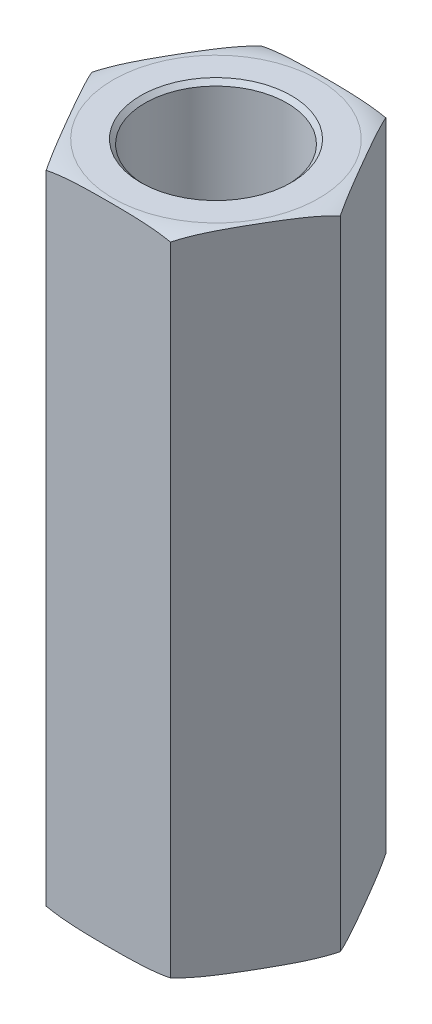
ISO-10303-21;
HEADER;
FILE_DESCRIPTION(('STEP AP214'),'2;1');
FILE_NAME('part.step','',(''),(''),'','','');
FILE_SCHEMA(('AUTOMOTIVE_DESIGN { 1 0 10303 214 1 1 1 1 }'));
ENDSEC;
DATA;
#1=APPLICATION_CONTEXT('core data for automotive mechanical design processes');
#2=APPLICATION_PROTOCOL_DEFINITION('international standard','automotive_design',2000,#1);
#3=PRODUCT_CONTEXT('',#1,'mechanical');
#4=PRODUCT('Part','Part','',(#3));
#5=PRODUCT_RELATED_PRODUCT_CATEGORY('part','',(#4));
#6=PRODUCT_DEFINITION_FORMATION('','',#4);
#7=PRODUCT_DEFINITION_CONTEXT('part definition',#1,'design');
#8=PRODUCT_DEFINITION('design','',#6,#7);
#9=PRODUCT_DEFINITION_SHAPE('','',#8);
#10=(LENGTH_UNIT() NAMED_UNIT(*) SI_UNIT(.MILLI.,.METRE.));
#11=(NAMED_UNIT(*) PLANE_ANGLE_UNIT() SI_UNIT($,.RADIAN.));
#12=(NAMED_UNIT(*) SI_UNIT($,.STERADIAN.) SOLID_ANGLE_UNIT());
#13=UNCERTAINTY_MEASURE_WITH_UNIT(LENGTH_MEASURE(1.E-05),#10,'distance_accuracy_value','');
#14=(GEOMETRIC_REPRESENTATION_CONTEXT(3) GLOBAL_UNCERTAINTY_ASSIGNED_CONTEXT((#13)) GLOBAL_UNIT_ASSIGNED_CONTEXT((#10,
#11,#12)) REPRESENTATION_CONTEXT('',''));
#15=CARTESIAN_POINT('',(0.,0.,0.));
#16=DIRECTION('',(0.,0.,1.));
#17=DIRECTION('',(1.,0.,0.));
#18=AXIS2_PLACEMENT_3D('',#15,#16,#17);
#19=CARTESIAN_POINT('',(3.66617420935412,9.525,0.));
#20=DIRECTION('',(-0.866025403784439,0.,0.5));
#21=DIRECTION('',(0.5,0.,0.866025403784439));
#22=AXIS2_PLACEMENT_3D('',#19,#20,#21);
#23=PLANE('',#22);
#24=CARTESIAN_POINT('',(3.66617420935412,9.398,0.));
#25=CARTESIAN_POINT('',(3.63753042799203,9.40993202468709,-0.0496124846400275));
#26=CARTESIAN_POINT('',(3.60875945805376,9.42055614694223,-0.0994452663561576));
#27=CARTESIAN_POINT('',(3.5510445941875,9.43952869380446,-0.199410342924434));
#28=CARTESIAN_POINT('',(3.52210079717004,9.44787829008084,-0.249542469922636));
#29=CARTESIAN_POINT('',(3.43520914920621,9.47001015084215,-0.400043218949384));
#30=CARTESIAN_POINT('',(3.37708055050429,9.48092253839952,-0.500724905273881));
#31=CARTESIAN_POINT('',(3.26070078255249,9.4975474670846,-0.702300576339476));
#32=CARTESIAN_POINT('',(3.20244972255356,9.50326351393611,-0.803194371852361));
#33=CARTESIAN_POINT('',(3.08586365366197,9.51154325238667,-1.00512736662733));
#34=CARTESIAN_POINT('',(3.02752861562773,9.5141051045623,-1.1061666163641));
#35=CARTESIAN_POINT('',(2.91138213832281,9.5174800878033,-1.30733821617637));
#36=CARTESIAN_POINT('',(2.85357078573453,9.51830898530758,-1.40747041611355));
#37=CARTESIAN_POINT('',(2.73795502274299,9.51890235146376,-1.60772279177072));
#38=CARTESIAN_POINT('',(2.68015061252642,9.51866697200316,-1.70784296716739));
#39=CARTESIAN_POINT('',(2.56452713843041,9.51693398748164,-1.9081086988493));
#40=CARTESIAN_POINT('',(2.50670807591217,9.51543597123025,-2.00825425277689));
#41=CARTESIAN_POINT('',(2.39109525560102,9.51017531674577,-2.20850153156214));
#42=CARTESIAN_POINT('',(2.33330149587798,9.50641290136093,-2.30860325976287));
#43=CARTESIAN_POINT('',(2.23849359853911,9.49698899303816,-2.47281535491256));
#44=CARTESIAN_POINT('',(2.20145192539195,9.49249057663768,-2.5369734148008));
#45=CARTESIAN_POINT('',(2.12747060706785,9.48130148199487,-2.66511281694908));
#46=CARTESIAN_POINT('',(2.09053091530161,9.47461207209161,-2.72909423990413));
#47=CARTESIAN_POINT('',(2.01669860633929,9.45839780386584,-2.85697555026699));
#48=CARTESIAN_POINT('',(1.97980639337021,9.44886525006224,-2.92087473753309));
#49=CARTESIAN_POINT('',(1.90623831426152,9.42626291445617,-3.04829838836459));
#50=CARTESIAN_POINT('',(1.86956287153406,9.41318767878213,-3.11182211855863));
#51=CARTESIAN_POINT('',(1.83308710467706,9.398,-3.175));
#52=B_SPLINE_CURVE_WITH_KNOTS('',3,(#24,#25,#26,#27,#28,#29,#30,#31,#32,#33,#34,#35,#36,#37,#38,
#39,#40,#41,#42,#43,#44,#45,#46,#47,#48,#49,#50,#51),.UNSPECIFIED.,.F.,.F.,(4,2,2,2,2,2,2,2,2,2,
2,2,2,4),(0.,0.17550946738822,0.350928353443244,0.701031261588482,1.05089779629354,
1.40096826525493,1.74783967758031,2.09466158796881,2.44159648808703,2.78849725058543,
3.0111319819994,3.23363806003511,3.45675194236245,3.68021127402553),.UNSPECIFIED.);
#53=CARTESIAN_POINT('',(3.66617420935412,9.398,0.));
#54=VERTEX_POINT('',#53);
#55=CARTESIAN_POINT('',(1.83308710467706,9.398,-3.175));
#56=VERTEX_POINT('',#55);
#57=EDGE_CURVE('E107',#54,#56,#52,.T.);
#58=ORIENTED_EDGE('',*,*,#57,.F.);
#59=DIRECTION('',(0.,1.,0.));
#60=VECTOR('',#59,1.);
#61=CARTESIAN_POINT('',(3.66617420935412,9.525,0.));
#62=LINE('',#61,#60);
#63=CARTESIAN_POINT('',(3.66617420935412,-9.398,0.));
#64=VERTEX_POINT('',#63);
#65=EDGE_CURVE('E80',#54,#64,#62,.F.);
#66=ORIENTED_EDGE('',*,*,#65,.T.);
#67=CARTESIAN_POINT('',(1.83308710467705,-9.398,-3.17500000000001));
#68=CARTESIAN_POINT('',(1.86173088603914,-9.40993202468709,-3.12538751535998));
#69=CARTESIAN_POINT('',(1.89050185597741,-9.42055614694223,-3.07555473364385));
#70=CARTESIAN_POINT('',(1.94821671984367,-9.43952869380445,-2.97558965707558));
#71=CARTESIAN_POINT('',(1.97716051686113,-9.44787829008084,-2.92545753007738));
#72=CARTESIAN_POINT('',(2.06405216482496,-9.47001015084215,-2.77495678105063));
#73=CARTESIAN_POINT('',(2.12218076352687,-9.48092253839952,-2.67427509472614));
#74=CARTESIAN_POINT('',(2.23856053147867,-9.4975474670846,-2.47269942366054));
#75=CARTESIAN_POINT('',(2.2968115914776,-9.50326351393611,-2.37180562814766));
#76=CARTESIAN_POINT('',(2.41339766036919,-9.51154325238667,-2.1698726333727));
#77=CARTESIAN_POINT('',(2.47173269840343,-9.5141051045623,-2.06883338363593));
#78=CARTESIAN_POINT('',(2.58787917570835,-9.5174800878033,-1.86766178382366));
#79=CARTESIAN_POINT('',(2.64569052829663,-9.51830898530758,-1.76752958388648));
#80=CARTESIAN_POINT('',(2.76130629128816,-9.51890235146376,-1.56727720822931));
#81=CARTESIAN_POINT('',(2.81911070150473,-9.51866697200316,-1.46715703283265));
#82=CARTESIAN_POINT('',(2.93473417560074,-9.51693398748165,-1.26689130115074));
#83=CARTESIAN_POINT('',(2.99255323811898,-9.51543597123026,-1.16674574722316));
#84=CARTESIAN_POINT('',(3.10816605843013,-9.51017531674577,-0.966498468437907));
#85=CARTESIAN_POINT('',(3.16595981815317,-9.50641290136093,-0.866396740237176));
#86=CARTESIAN_POINT('',(3.26076771549203,-9.49698899303816,-0.702184645087488));
#87=CARTESIAN_POINT('',(3.2978093886392,-9.49249057663768,-0.63802658519924));
#88=CARTESIAN_POINT('',(3.37179070696331,-9.48130148199488,-0.509887183050958));
#89=CARTESIAN_POINT('',(3.40873039872954,-9.47461207209161,-0.445905760095904));
#90=CARTESIAN_POINT('',(3.48256270769187,-9.45839780386584,-0.318024449733033));
#91=CARTESIAN_POINT('',(3.51945492066095,-9.44886525006225,-0.254125262466928));
#92=CARTESIAN_POINT('',(3.59302299976965,-9.42626291445618,-0.126701611635421));
#93=CARTESIAN_POINT('',(3.62969844249711,-9.41318767878214,-0.0631778814413773));
#94=CARTESIAN_POINT('',(3.66617420935412,-9.398,0.));
#95=B_SPLINE_CURVE_WITH_KNOTS('',3,(#67,#68,#69,#70,#71,#72,#73,#74,#75,#76,#77,#78,#79,#80,#81,
#82,#83,#84,#85,#86,#87,#88,#89,#90,#91,#92,#93,#94),.UNSPECIFIED.,.F.,.F.,(4,2,2,2,2,2,2,2,2,2,
2,2,2,4),(0.,0.175509467388216,0.350928353443236,0.701031261588468,1.05089779629352,
1.4009682652549,1.74783967758028,2.09466158796877,2.44159648808698,2.78849725058538,
3.01113198199936,3.23363806003509,3.45675194236244,3.68021127402553),.UNSPECIFIED.);
#96=CARTESIAN_POINT('',(1.83308710467705,-9.398,-3.175));
#97=VERTEX_POINT('',#96);
#98=EDGE_CURVE('E97',#97,#64,#95,.T.);
#99=ORIENTED_EDGE('',*,*,#98,.F.);
#100=DIRECTION('',(0.,1.,0.));
#101=VECTOR('',#100,1.);
#102=CARTESIAN_POINT('',(1.83308710467705,9.525,-3.175));
#103=LINE('',#102,#101);
#104=EDGE_CURVE('E111',#97,#56,#103,.T.);
#105=ORIENTED_EDGE('',*,*,#104,.T.);
#106=EDGE_LOOP('',(#58,#66,#99,#105));
#107=FACE_BOUND('',#106,.T.);
#108=ADVANCED_FACE('F17',(#107),#23,.F.);
#109=CARTESIAN_POINT('',(1.83308710467706,9.525,3.17499999999999));
#110=DIRECTION('',(-0.866025403784439,0.,-0.5));
#111=DIRECTION('',(-0.5,0.,0.866025403784439));
#112=AXIS2_PLACEMENT_3D('',#109,#110,#111);
#113=PLANE('',#112);
#114=CARTESIAN_POINT('',(1.83308710467706,9.398,3.17499999999999));
#115=CARTESIAN_POINT('',(1.86173088603915,9.40993202468709,3.12538751535996));
#116=CARTESIAN_POINT('',(1.89050185597743,9.42055614694223,3.07555473364383));
#117=CARTESIAN_POINT('',(1.94821671984368,9.43952869380446,2.97558965707556));
#118=CARTESIAN_POINT('',(1.97716051686114,9.44787829008084,2.92545753007735));
#119=CARTESIAN_POINT('',(2.06405216482498,9.47001015084215,2.77495678105061));
#120=CARTESIAN_POINT('',(2.12218076352689,9.48092253839952,2.67427509472611));
#121=CARTESIAN_POINT('',(2.23856053147869,9.4975474670846,2.47269942366051));
#122=CARTESIAN_POINT('',(2.29681159147762,9.50326351393611,2.37180562814763));
#123=CARTESIAN_POINT('',(2.41339766036921,9.51154325238667,2.16987263337266));
#124=CARTESIAN_POINT('',(2.47173269840345,9.5141051045623,2.06883338363589));
#125=CARTESIAN_POINT('',(2.58787917570837,9.5174800878033,1.86766178382362));
#126=CARTESIAN_POINT('',(2.64569052829666,9.51830898530758,1.76752958388644));
#127=CARTESIAN_POINT('',(2.76130629128819,9.51890235146376,1.56727720822927));
#128=CARTESIAN_POINT('',(2.81911070150476,9.51866697200316,1.4671570328326));
#129=CARTESIAN_POINT('',(2.93473417560078,9.51693398748164,1.26689130115069));
#130=CARTESIAN_POINT('',(2.99255323811901,9.51543597123025,1.1667457472231));
#131=CARTESIAN_POINT('',(3.10816605843017,9.51017531674577,0.966498468437848));
#132=CARTESIAN_POINT('',(3.16595981815321,9.50641290136093,0.866396740237115));
#133=CARTESIAN_POINT('',(3.26076771549207,9.49698899303816,0.702184645087431));
#134=CARTESIAN_POINT('',(3.29780938863923,9.49249057663768,0.638026585199189));
#135=CARTESIAN_POINT('',(3.37179070696333,9.48130148199487,0.509887183050919));
#136=CARTESIAN_POINT('',(3.40873039872956,9.47461207209161,0.44590576009587));
#137=CARTESIAN_POINT('',(3.48256270769188,9.45839780386584,0.31802444973301));
#138=CARTESIAN_POINT('',(3.51945492066096,9.44886525006224,0.254125262466912));
#139=CARTESIAN_POINT('',(3.59302299976965,9.42626291445617,0.126701611635416));
#140=CARTESIAN_POINT('',(3.62969844249711,9.41318767878213,0.0631778814413771));
#141=CARTESIAN_POINT('',(3.66617420935412,9.398,0.));
#142=B_SPLINE_CURVE_WITH_KNOTS('',3,(#114,#115,#116,#117,#118,#119,#120,#121,#122,#123,#124,
#125,#126,#127,#128,#129,#130,#131,#132,#133,#134,#135,#136,#137,#138,#139,#140,#141),
.UNSPECIFIED.,.F.,.F.,(4,2,2,2,2,2,2,2,2,2,2,2,2,4),(0.,0.17550946738822,0.350928353443244,
0.701031261588483,1.05089779629354,1.40096826525493,1.74783967758031,2.09466158796881,
2.44159648808703,2.78849725058544,3.01113198199939,3.2336380600351,3.45675194236244,
3.68021127402551),.UNSPECIFIED.);
#143=CARTESIAN_POINT('',(1.83308710467707,9.398,3.17499999999999));
#144=VERTEX_POINT('',#143);
#145=EDGE_CURVE('E22',#144,#54,#142,.T.);
#146=ORIENTED_EDGE('',*,*,#145,.F.);
#147=DIRECTION('',(0.,1.,0.));
#148=VECTOR('',#147,1.);
#149=CARTESIAN_POINT('',(1.83308710467707,9.525,3.17499999999999));
#150=LINE('',#149,#148);
#151=CARTESIAN_POINT('',(1.83308710467706,-9.398,3.17499999999999));
#152=VERTEX_POINT('',#151);
#153=EDGE_CURVE('E100',#144,#152,#150,.F.);
#154=ORIENTED_EDGE('',*,*,#153,.T.);
#155=CARTESIAN_POINT('',(3.66617420935412,-9.398,0.));
#156=CARTESIAN_POINT('',(3.63753042799203,-9.40993202468709,0.0496124846400324));
#157=CARTESIAN_POINT('',(3.60875945805375,-9.42055614694223,0.0994452663561624));
#158=CARTESIAN_POINT('',(3.5510445941875,-9.43952869380445,0.199410342924438));
#159=CARTESIAN_POINT('',(3.52210079717004,-9.44787829008084,0.24954246992264));
#160=CARTESIAN_POINT('',(3.43520914920621,-9.47001015084215,0.400043218949389));
#161=CARTESIAN_POINT('',(3.37708055050429,-9.48092253839952,0.500724905273886));
#162=CARTESIAN_POINT('',(3.26070078255249,-9.4975474670846,0.702300576339482));
#163=CARTESIAN_POINT('',(3.20244972255356,-9.50326351393611,0.803194371852367));
#164=CARTESIAN_POINT('',(3.08586365366197,-9.51154325238667,1.00512736662734));
#165=CARTESIAN_POINT('',(3.02752861562773,-9.5141051045623,1.1061666163641));
#166=CARTESIAN_POINT('',(2.91138213832281,-9.5174800878033,1.30733821617637));
#167=CARTESIAN_POINT('',(2.85357078573452,-9.51830898530758,1.40747041611356));
#168=CARTESIAN_POINT('',(2.73795502274299,-9.51890235146376,1.60772279177073));
#169=CARTESIAN_POINT('',(2.68015061252642,-9.51866697200316,1.70784296716739));
#170=CARTESIAN_POINT('',(2.5645271384304,-9.51693398748164,1.90810869884931));
#171=CARTESIAN_POINT('',(2.50670807591217,-9.51543597123025,2.00825425277689));
#172=CARTESIAN_POINT('',(2.39109525560101,-9.51017531674577,2.20850153156215));
#173=CARTESIAN_POINT('',(2.33330149587797,-9.50641290136093,2.30860325976288));
#174=CARTESIAN_POINT('',(2.23849359853911,-9.49698899303816,2.47281535491257));
#175=CARTESIAN_POINT('',(2.20145192539195,-9.49249057663768,2.53697341480081));
#176=CARTESIAN_POINT('',(2.12747060706785,-9.48130148199487,2.66511281694908));
#177=CARTESIAN_POINT('',(2.09053091530162,-9.47461207209161,2.72909423990413));
#178=CARTESIAN_POINT('',(2.0166986063393,-9.45839780386584,2.85697555026699));
#179=CARTESIAN_POINT('',(1.97980639337022,-9.44886525006225,2.92087473753308));
#180=CARTESIAN_POINT('',(1.90623831426153,-9.42626291445618,3.04829838836458));
#181=CARTESIAN_POINT('',(1.86956287153407,-9.41318767878214,3.11182211855862));
#182=CARTESIAN_POINT('',(1.83308710467706,-9.398,3.17499999999999));
#183=B_SPLINE_CURVE_WITH_KNOTS('',3,(#155,#156,#157,#158,#159,#160,#161,#162,#163,#164,#165,
#166,#167,#168,#169,#170,#171,#172,#173,#174,#175,#176,#177,#178,#179,#180,#181,#182),
.UNSPECIFIED.,.F.,.F.,(4,2,2,2,2,2,2,2,2,2,2,2,2,4),(0.,0.175509467388219,0.350928353443244,
0.701031261588483,1.05089779629354,1.40096826525493,1.74783967758031,2.09466158796881,
2.44159648808703,2.78849725058544,3.01113198199939,3.2336380600351,3.45675194236244,
3.68021127402551),.UNSPECIFIED.);
#184=EDGE_CURVE('E205',#64,#152,#183,.T.);
#185=ORIENTED_EDGE('',*,*,#184,.F.);
#186=ORIENTED_EDGE('',*,*,#65,.F.);
#187=EDGE_LOOP('',(#146,#154,#185,#186));
#188=FACE_BOUND('',#187,.T.);
#189=ADVANCED_FACE('F106',(#188),#113,.F.);
#190=CARTESIAN_POINT('',(-1.83308710467707,9.525,3.175));
#191=DIRECTION('',(0.,0.,-1.));
#192=DIRECTION('',(-1.,0.,0.));
#193=AXIS2_PLACEMENT_3D('',#190,#191,#192);
#194=PLANE('',#193);
#195=ORIENTED_EDGE('',*,*,#153,.F.);
#196=CARTESIAN_POINT('',(-1.83308710467707,9.39799999999999,3.175));
#197=CARTESIAN_POINT('',(-1.75760871054776,9.41371230122365,3.175));
#198=CARTESIAN_POINT('',(-1.68170571468658,9.4271647800808,3.175));
#199=CARTESIAN_POINT('',(-1.52939807527773,9.45030486470105,3.175));
#200=CARTESIAN_POINT('',(-1.45299400110163,9.45999617502722,3.175));
#201=CARTESIAN_POINT('',(-1.30011823209763,9.47637135267139,3.175));
#202=CARTESIAN_POINT('',(-1.22364747610196,9.48306442247852,3.175));
#203=CARTESIAN_POINT('',(-1.07052459410173,9.49417241699752,3.175));
#204=CARTESIAN_POINT('',(-0.993872424115956,9.49858671655426,3.175));
#205=CARTESIAN_POINT('',(-0.840856910195845,9.50572419802799,3.175));
#206=CARTESIAN_POINT('',(-0.764493913329281,9.50845527367792,3.175));
#207=CARTESIAN_POINT('',(-0.611734616938516,9.51275632258004,3.175));
#208=CARTESIAN_POINT('',(-0.535338316331409,9.51432625473884,3.175));
#209=CARTESIAN_POINT('',(-0.38245423122642,9.51668247076568,3.175));
#210=CARTESIAN_POINT('',(-0.305966435115039,9.51746792759645,3.175));
#211=CARTESIAN_POINT('',(-0.152985759387012,9.51848841069005,3.175));
#212=CARTESIAN_POINT('',(-0.076492879693506,9.51872342414921,3.175));
#213=CARTESIAN_POINT('',(0.0764928796935065,9.51872342414921,3.175));
#214=CARTESIAN_POINT('',(0.152985759387013,9.51848841069005,3.17499999999999));
#215=CARTESIAN_POINT('',(0.305966435115039,9.51746792759645,3.17499999999999));
#216=CARTESIAN_POINT('',(0.38245423122642,9.51668247076568,3.17499999999999));
#217=CARTESIAN_POINT('',(0.535338316331409,9.51432625473884,3.17499999999999));
#218=CARTESIAN_POINT('',(0.611734616938516,9.51275632258004,3.17499999999999));
#219=CARTESIAN_POINT('',(0.764493913329281,9.50845527367792,3.17499999999999));
#220=CARTESIAN_POINT('',(0.840856910195845,9.50572419802799,3.17499999999999));
#221=CARTESIAN_POINT('',(0.993872424115955,9.49858671655426,3.17499999999999));
#222=CARTESIAN_POINT('',(1.07052459410172,9.49417241699752,3.17499999999999));
#223=CARTESIAN_POINT('',(1.22364747610196,9.48306442247852,3.17499999999999));
#224=CARTESIAN_POINT('',(1.30011823209763,9.47637135267139,3.17499999999999));
#225=CARTESIAN_POINT('',(1.45299400110163,9.45999617502723,3.17499999999999));
#226=CARTESIAN_POINT('',(1.52939807527773,9.45030486470105,3.17499999999999));
#227=CARTESIAN_POINT('',(1.68170571468658,9.42716478008081,3.17499999999999));
#228=CARTESIAN_POINT('',(1.75760871054776,9.41371230122365,3.17499999999999));
#229=CARTESIAN_POINT('',(1.83308710467707,9.398,3.17499999999999));
#230=B_SPLINE_CURVE_WITH_KNOTS('',3,(#196,#197,#198,#199,#200,#201,#202,#203,#204,#205,#206,
#207,#208,#209,#210,#211,#212,#213,#214,#215,#216,#217,#218,#219,#220,#221,#222,#223,#224,#225,
#226,#227,#228,#229),.UNSPECIFIED.,.F.,.F.,(4,2,2,2,2,2,2,2,2,2,2,2,2,2,2,2,4),(0.,
0.23119079437731,0.46215329593589,0.692401964780504,0.922713766248053,1.15193709952408,
1.3811685447265,1.61064140410055,1.84011960111017,2.06959779811978,2.29907065749383,
2.52830210269626,2.75752543597228,2.98783723743982,3.21808590628444,3.44904840784302,
3.68023920222033),.UNSPECIFIED.);
#231=CARTESIAN_POINT('',(-1.83308710467707,9.398,3.175));
#232=VERTEX_POINT('',#231);
#233=EDGE_CURVE('E86',#232,#144,#230,.T.);
#234=ORIENTED_EDGE('',*,*,#233,.F.);
#235=DIRECTION('',(0.,1.,0.));
#236=VECTOR('',#235,1.);
#237=CARTESIAN_POINT('',(-1.83308710467707,9.525,3.175));
#238=LINE('',#237,#236);
#239=CARTESIAN_POINT('',(-1.83308710467707,-9.398,3.175));
#240=VERTEX_POINT('',#239);
#241=EDGE_CURVE('E104',#232,#240,#238,.F.);
#242=ORIENTED_EDGE('',*,*,#241,.T.);
#243=CARTESIAN_POINT('',(1.83308710467706,-9.398,3.17499999999999));
#244=CARTESIAN_POINT('',(1.75760871054776,-9.41371230122365,3.17499999999999));
#245=CARTESIAN_POINT('',(1.68170571468658,-9.42716478008081,3.17499999999999));
#246=CARTESIAN_POINT('',(1.52939807527773,-9.45030486470105,3.17499999999999));
#247=CARTESIAN_POINT('',(1.45299400110163,-9.45999617502723,3.17499999999999));
#248=CARTESIAN_POINT('',(1.30011823209763,-9.47637135267139,3.17499999999999));
#249=CARTESIAN_POINT('',(1.22364747610196,-9.48306442247852,3.17499999999999));
#250=CARTESIAN_POINT('',(1.07052459410172,-9.49417241699752,3.17499999999999));
#251=CARTESIAN_POINT('',(0.993872424115954,-9.49858671655426,3.17499999999999));
#252=CARTESIAN_POINT('',(0.840856910195844,-9.50572419802799,3.17499999999999));
#253=CARTESIAN_POINT('',(0.76449391332928,-9.50845527367792,3.17499999999999));
#254=CARTESIAN_POINT('',(0.611734616938514,-9.51275632258004,3.17499999999999));
#255=CARTESIAN_POINT('',(0.535338316331408,-9.51432625473884,3.17499999999999));
#256=CARTESIAN_POINT('',(0.382454231226419,-9.51668247076568,3.17499999999999));
#257=CARTESIAN_POINT('',(0.305966435115038,-9.51746792759645,3.17499999999999));
#258=CARTESIAN_POINT('',(0.152985759387012,-9.51848841069005,3.17499999999999));
#259=CARTESIAN_POINT('',(0.076492879693506,-9.51872342414921,3.175));
#260=CARTESIAN_POINT('',(-0.0764928796935062,-9.51872342414921,3.175));
#261=CARTESIAN_POINT('',(-0.152985759387012,-9.51848841069005,3.175));
#262=CARTESIAN_POINT('',(-0.305966435115038,-9.51746792759645,3.175));
#263=CARTESIAN_POINT('',(-0.382454231226419,-9.51668247076568,3.175));
#264=CARTESIAN_POINT('',(-0.535338316331408,-9.51432625473884,3.175));
#265=CARTESIAN_POINT('',(-0.611734616938515,-9.51275632258004,3.175));
#266=CARTESIAN_POINT('',(-0.76449391332928,-9.50845527367792,3.175));
#267=CARTESIAN_POINT('',(-0.840856910195844,-9.50572419802799,3.175));
#268=CARTESIAN_POINT('',(-0.993872424115954,-9.49858671655426,3.175));
#269=CARTESIAN_POINT('',(-1.07052459410172,-9.49417241699752,3.175));
#270=CARTESIAN_POINT('',(-1.22364747610196,-9.48306442247852,3.175));
#271=CARTESIAN_POINT('',(-1.30011823209763,-9.47637135267139,3.175));
#272=CARTESIAN_POINT('',(-1.45299400110163,-9.45999617502722,3.175));
#273=CARTESIAN_POINT('',(-1.52939807527773,-9.45030486470105,3.175));
#274=CARTESIAN_POINT('',(-1.68170571468658,-9.4271647800808,3.175));
#275=CARTESIAN_POINT('',(-1.75760871054776,-9.41371230122365,3.175));
#276=CARTESIAN_POINT('',(-1.83308710467706,-9.398,3.175));
#277=B_SPLINE_CURVE_WITH_KNOTS('',3,(#243,#244,#245,#246,#247,#248,#249,#250,#251,#252,#253,
#254,#255,#256,#257,#258,#259,#260,#261,#262,#263,#264,#265,#266,#267,#268,#269,#270,#271,#272,
#273,#274,#275,#276),.UNSPECIFIED.,.F.,.F.,(4,2,2,2,2,2,2,2,2,2,2,2,2,2,2,2,4),(0.,
0.23119079437731,0.462153295935889,0.692401964780503,0.922713766248051,1.15193709952407,
1.3811685447265,1.61064140410055,1.84011960111016,2.06959779811977,2.29907065749383,
2.52830210269625,2.75752543597227,2.98783723743982,3.21808590628443,3.44904840784301,
3.68023920222032),.UNSPECIFIED.);
#278=EDGE_CURVE('E102',#152,#240,#277,.T.);
#279=ORIENTED_EDGE('',*,*,#278,.F.);
#280=EDGE_LOOP('',(#195,#234,#242,#279));
#281=FACE_BOUND('',#280,.T.);
#282=ADVANCED_FACE('F101',(#281),#194,.F.);
#283=CARTESIAN_POINT('',(-3.66617420935413,9.525,0.));
#284=DIRECTION('',(0.866025403784439,0.,-0.499999999999999));
#285=DIRECTION('',(-0.499999999999999,0.,-0.866025403784439));
#286=AXIS2_PLACEMENT_3D('',#283,#284,#285);
#287=PLANE('',#286);
#288=CARTESIAN_POINT('',(-3.66617420935412,9.39799999999999,0.));
#289=CARTESIAN_POINT('',(-3.63753042799204,9.40993202468708,0.0496124846400222));
#290=CARTESIAN_POINT('',(-3.60875945805377,9.42055614694222,0.0994452663561455));
#291=CARTESIAN_POINT('',(-3.55104459418752,9.43952869380445,0.199410342924408));
#292=CARTESIAN_POINT('',(-3.52210079717006,9.44787829008083,0.249542469922603));
#293=CARTESIAN_POINT('',(-3.43520914920624,9.47001015084215,0.400043218949332));
#294=CARTESIAN_POINT('',(-3.37708055050434,9.48092253839951,0.500724905273816));
#295=CARTESIAN_POINT('',(-3.26070078255255,9.4975474670846,0.702300576339384));
#296=CARTESIAN_POINT('',(-3.20244972255363,9.50326351393611,0.803194371852256));
#297=CARTESIAN_POINT('',(-3.08586365366205,9.51154325238667,1.0051273666272));
#298=CARTESIAN_POINT('',(-3.02752861562782,9.5141051045623,1.10616661636395));
#299=CARTESIAN_POINT('',(-2.91138213832292,9.5174800878033,1.30733821617619));
#300=CARTESIAN_POINT('',(-2.85357078573464,9.51830898530758,1.40747041611336));
#301=CARTESIAN_POINT('',(-2.73795502274313,9.51890235146376,1.60772279177051));
#302=CARTESIAN_POINT('',(-2.68015061252656,9.51866697200317,1.70784296716716));
#303=CARTESIAN_POINT('',(-2.56452713843056,9.51693398748165,1.90810869884905));
#304=CARTESIAN_POINT('',(-2.50670807591233,9.51543597123026,2.00825425277662));
#305=CARTESIAN_POINT('',(-2.39109525560119,9.51017531674578,2.20850153156185));
#306=CARTESIAN_POINT('',(-2.33330149587816,9.50641290136095,2.30860325976257));
#307=CARTESIAN_POINT('',(-2.23849359853929,9.49698899303818,2.47281535491227));
#308=CARTESIAN_POINT('',(-2.20145192539211,9.4924905766377,2.53697341480054));
#309=CARTESIAN_POINT('',(-2.12747060706798,9.48130148199489,2.66511281694887));
#310=CARTESIAN_POINT('',(-2.09053091530173,9.47461207209163,2.72909423990394));
#311=CARTESIAN_POINT('',(-2.01669860633938,9.45839780386585,2.85697555026686));
#312=CARTESIAN_POINT('',(-1.97980639337028,9.44886525006226,2.92087473753298));
#313=CARTESIAN_POINT('',(-1.90623831426156,9.42626291445618,3.04829838836453));
#314=CARTESIAN_POINT('',(-1.86956287153409,9.41318767878214,3.1118221185586));
#315=CARTESIAN_POINT('',(-1.83308710467707,9.39799999999999,3.175));
#316=B_SPLINE_CURVE_WITH_KNOTS('',3,(#288,#289,#290,#291,#292,#293,#294,#295,#296,#297,#298,
#299,#300,#301,#302,#303,#304,#305,#306,#307,#308,#309,#310,#311,#312,#313,#314,#315),
.UNSPECIFIED.,.F.,.F.,(4,2,2,2,2,2,2,2,2,2,2,2,2,4),(0.,0.175509467388196,0.350928353443197,
0.70103126158839,1.0508977962934,1.40096826525474,1.74783967758008,2.09466158796853,
2.4415964880867,2.78849725058507,3.01113198199912,3.23363806003492,3.45675194236235,
3.68021127402552),.UNSPECIFIED.);
#317=CARTESIAN_POINT('',(-3.66617420935413,9.39799999999999,0.));
#318=VERTEX_POINT('',#317);
#319=EDGE_CURVE('E94',#318,#232,#316,.T.);
#320=ORIENTED_EDGE('',*,*,#319,.F.);
#321=DIRECTION('',(0.,1.,0.));
#322=VECTOR('',#321,1.);
#323=CARTESIAN_POINT('',(-3.66617420935413,9.525,0.));
#324=LINE('',#323,#322);
#325=CARTESIAN_POINT('',(-3.66617420935413,-9.398,0.));
#326=VERTEX_POINT('',#325);
#327=EDGE_CURVE('E118',#318,#326,#324,.F.);
#328=ORIENTED_EDGE('',*,*,#327,.T.);
#329=CARTESIAN_POINT('',(-1.83308710467707,-9.39799999999999,3.175));
#330=CARTESIAN_POINT('',(-1.86173088603915,-9.40993202468708,3.12538751535998));
#331=CARTESIAN_POINT('',(-1.89050185597742,-9.42055614694222,3.07555473364385));
#332=CARTESIAN_POINT('',(-1.94821671984367,-9.43952869380445,2.97558965707558));
#333=CARTESIAN_POINT('',(-1.97716051686113,-9.44787829008083,2.92545753007739));
#334=CARTESIAN_POINT('',(-2.06405216482496,-9.47001015084215,2.77495678105065));
#335=CARTESIAN_POINT('',(-2.12218076352686,-9.48092253839952,2.67427509472617));
#336=CARTESIAN_POINT('',(-2.23856053147865,-9.4975474670846,2.47269942366059));
#337=CARTESIAN_POINT('',(-2.29681159147757,-9.50326351393611,2.37180562814772));
#338=CARTESIAN_POINT('',(-2.41339766036916,-9.51154325238667,2.16987263337277));
#339=CARTESIAN_POINT('',(-2.47173269840339,-9.5141051045623,2.06883338363601));
#340=CARTESIAN_POINT('',(-2.5878791757083,-9.5174800878033,1.86766178382376));
#341=CARTESIAN_POINT('',(-2.64569052829658,-9.51830898530758,1.76752958388659));
#342=CARTESIAN_POINT('',(-2.7613062912881,-9.51890235146376,1.56727720822944));
#343=CARTESIAN_POINT('',(-2.81911070150467,-9.51866697200316,1.46715703283278));
#344=CARTESIAN_POINT('',(-2.93473417560067,-9.51693398748165,1.26689130115088));
#345=CARTESIAN_POINT('',(-2.9925532381189,-9.51543597123026,1.16674574722331));
#346=CARTESIAN_POINT('',(-3.10816605843004,-9.51017531674578,0.966498468438076));
#347=CARTESIAN_POINT('',(-3.16595981815307,-9.50641290136094,0.866396740237353));
#348=CARTESIAN_POINT('',(-3.26076771549194,-9.49698899303818,0.702184645087658));
#349=CARTESIAN_POINT('',(-3.29780938863912,-9.49249057663769,0.638026585199395));
#350=CARTESIAN_POINT('',(-3.37179070696324,-9.48130148199489,0.509887183051082));
#351=CARTESIAN_POINT('',(-3.40873039872949,-9.47461207209162,0.445905760096013));
#352=CARTESIAN_POINT('',(-3.48256270769183,-9.45839780386585,0.318024449733112));
#353=CARTESIAN_POINT('',(-3.51945492066092,-9.44886525006225,0.254125262466993));
#354=CARTESIAN_POINT('',(-3.59302299976963,-9.42626291445618,0.126701611635455));
#355=CARTESIAN_POINT('',(-3.6296984424971,-9.41318767878214,0.0631778814413959));
#356=CARTESIAN_POINT('',(-3.66617420935412,-9.398,0.));
#357=B_SPLINE_CURVE_WITH_KNOTS('',3,(#329,#330,#331,#332,#333,#334,#335,#336,#337,#338,#339,
#340,#341,#342,#343,#344,#345,#346,#347,#348,#349,#350,#351,#352,#353,#354,#355,#356),
.UNSPECIFIED.,.F.,.F.,(4,2,2,2,2,2,2,2,2,2,2,2,2,4),(0.,0.175509467388203,0.350928353443209,
0.701031261588413,1.05089779629344,1.40096826525479,1.74783967758014,2.0946615879686,
2.44159648808678,2.78849725058516,3.01113198199919,3.23363806003497,3.45675194236238,
3.68021127402552),.UNSPECIFIED.);
#358=EDGE_CURVE('E196',#240,#326,#357,.T.);
#359=ORIENTED_EDGE('',*,*,#358,.F.);
#360=ORIENTED_EDGE('',*,*,#241,.F.);
#361=EDGE_LOOP('',(#320,#328,#359,#360));
#362=FACE_BOUND('',#361,.T.);
#363=ADVANCED_FACE('F190',(#362),#287,.F.);
#364=CARTESIAN_POINT('',(-1.83308710467707,9.525,-3.175));
#365=DIRECTION('',(0.866025403784439,0.,0.5));
#366=DIRECTION('',(0.5,0.,-0.866025403784439));
#367=AXIS2_PLACEMENT_3D('',#364,#365,#366);
#368=PLANE('',#367);
#369=CARTESIAN_POINT('',(-1.83308710467706,9.39799999999999,-3.17500000000001));
#370=CARTESIAN_POINT('',(-1.86173088603915,9.40993202468708,-3.12538751535999));
#371=CARTESIAN_POINT('',(-1.89050185597742,9.42055614694222,-3.07555473364386));
#372=CARTESIAN_POINT('',(-1.94821671984366,9.43952869380445,-2.9755896570756));
#373=CARTESIAN_POINT('',(-1.97716051686112,9.44787829008083,-2.92545753007741));
#374=CARTESIAN_POINT('',(-2.06405216482494,9.47001015084215,-2.77495678105068));
#375=CARTESIAN_POINT('',(-2.12218076352685,9.48092253839951,-2.6742750947262));
#376=CARTESIAN_POINT('',(-2.23856053147863,9.4975474670846,-2.47269942366064));
#377=CARTESIAN_POINT('',(-2.29681159147755,9.50326351393611,-2.37180562814777));
#378=CARTESIAN_POINT('',(-2.41339766036912,9.51154325238667,-2.16987263337283));
#379=CARTESIAN_POINT('',(-2.47173269840336,9.5141051045623,-2.06883338363608));
#380=CARTESIAN_POINT('',(-2.58787917570826,9.5174800878033,-1.86766178382384));
#381=CARTESIAN_POINT('',(-2.64569052829653,9.51830898530758,-1.76752958388667));
#382=CARTESIAN_POINT('',(-2.76130629128805,9.51890235146376,-1.56727720822953));
#383=CARTESIAN_POINT('',(-2.81911070150462,9.51866697200317,-1.46715703283288));
#384=CARTESIAN_POINT('',(-2.93473417560061,9.51693398748165,-1.26689130115099));
#385=CARTESIAN_POINT('',(-2.99255323811884,9.51543597123026,-1.16674574722342));
#386=CARTESIAN_POINT('',(-3.10816605842998,9.51017531674579,-0.966498468438198));
#387=CARTESIAN_POINT('',(-3.16595981815301,9.50641290136095,-0.86639674023748));
#388=CARTESIAN_POINT('',(-3.26076771549188,9.49698899303819,-0.702184645087778));
#389=CARTESIAN_POINT('',(-3.29780938863906,9.4924905766377,-0.638026585199504));
#390=CARTESIAN_POINT('',(-3.3717907069632,9.4813014819949,-0.50988718305117));
#391=CARTESIAN_POINT('',(-3.40873039872945,9.47461207209163,-0.44590576009609));
#392=CARTESIAN_POINT('',(-3.4825627076918,9.45839780386586,-0.318024449733166));
#393=CARTESIAN_POINT('',(-3.5194549206609,9.44886525006226,-0.254125262467035));
#394=CARTESIAN_POINT('',(-3.59302299976963,9.42626291445618,-0.126701611635476));
#395=CARTESIAN_POINT('',(-3.6296984424971,9.41318767878213,-0.0631778814414058));
#396=CARTESIAN_POINT('',(-3.66617420935413,9.39799999999999,0.));
#397=B_SPLINE_CURVE_WITH_KNOTS('',3,(#369,#370,#371,#372,#373,#374,#375,#376,#377,#378,#379,
#380,#381,#382,#383,#384,#385,#386,#387,#388,#389,#390,#391,#392,#393,#394,#395,#396),
.UNSPECIFIED.,.F.,.F.,(4,2,2,2,2,2,2,2,2,2,2,2,2,4),(0.,0.175509467388193,0.350928353443191,
0.701031261588377,1.05089779629338,1.40096826525472,1.74783967758005,2.0946615879685,
2.44159648808666,2.78849725058502,3.01113198199908,3.2336380600349,3.45675194236235,
3.68021127402553),.UNSPECIFIED.);
#398=CARTESIAN_POINT('',(-1.83308710467706,9.398,-3.175));
#399=VERTEX_POINT('',#398);
#400=EDGE_CURVE('E166',#399,#318,#397,.T.);
#401=ORIENTED_EDGE('',*,*,#400,.F.);
#402=DIRECTION('',(0.,1.,0.));
#403=VECTOR('',#402,1.);
#404=CARTESIAN_POINT('',(-1.83308710467706,9.525,-3.175));
#405=LINE('',#404,#403);
#406=CARTESIAN_POINT('',(-1.83308710467707,-9.39799999999999,-3.175));
#407=VERTEX_POINT('',#406);
#408=EDGE_CURVE('E108',#399,#407,#405,.F.);
#409=ORIENTED_EDGE('',*,*,#408,.T.);
#410=CARTESIAN_POINT('',(-3.66617420935413,-9.39799999999999,0.));
#411=CARTESIAN_POINT('',(-3.63753042799204,-9.40993202468708,-0.0496124846400259));
#412=CARTESIAN_POINT('',(-3.60875945805377,-9.42055614694222,-0.0994452663561509));
#413=CARTESIAN_POINT('',(-3.55104459418752,-9.43952869380445,-0.199410342924416));
#414=CARTESIAN_POINT('',(-3.52210079717006,-9.44787829008083,-0.249542469922613));
#415=CARTESIAN_POINT('',(-3.43520914920624,-9.47001015084215,-0.400043218949346));
#416=CARTESIAN_POINT('',(-3.37708055050433,-9.48092253839952,-0.500724905273833));
#417=CARTESIAN_POINT('',(-3.26070078255254,-9.4975474670846,-0.702300576339408));
#418=CARTESIAN_POINT('',(-3.20244972255362,-9.50326351393611,-0.803194371852283));
#419=CARTESIAN_POINT('',(-3.08586365366204,-9.51154325238667,-1.00512736662723));
#420=CARTESIAN_POINT('',(-3.0275286156278,-9.5141051045623,-1.10616661636399));
#421=CARTESIAN_POINT('',(-2.91138213832289,-9.5174800878033,-1.30733821617624));
#422=CARTESIAN_POINT('',(-2.85357078573462,-9.51830898530758,-1.40747041611341));
#423=CARTESIAN_POINT('',(-2.7379550227431,-9.51890235146376,-1.60772279177056));
#424=CARTESIAN_POINT('',(-2.68015061252653,-9.51866697200316,-1.70784296716722));
#425=CARTESIAN_POINT('',(-2.56452713843053,-9.51693398748165,-1.90810869884911));
#426=CARTESIAN_POINT('',(-2.5067080759123,-9.51543597123026,-2.00825425277669));
#427=CARTESIAN_POINT('',(-2.39109525560115,-9.51017531674578,-2.20850153156192));
#428=CARTESIAN_POINT('',(-2.33330149587812,-9.50641290136094,-2.30860325976265));
#429=CARTESIAN_POINT('',(-2.23849359853925,-9.49698899303818,-2.47281535491234));
#430=CARTESIAN_POINT('',(-2.20145192539208,-9.49249057663769,-2.53697341480061));
#431=CARTESIAN_POINT('',(-2.12747060706795,-9.48130148199489,-2.66511281694892));
#432=CARTESIAN_POINT('',(-2.09053091530171,-9.47461207209162,-2.72909423990399));
#433=CARTESIAN_POINT('',(-2.01669860633936,-9.45839780386585,-2.85697555026689));
#434=CARTESIAN_POINT('',(-1.97980639337027,-9.44886525006225,-2.92087473753301));
#435=CARTESIAN_POINT('',(-1.90623831426156,-9.42626291445618,-3.04829838836455));
#436=CARTESIAN_POINT('',(-1.86956287153409,-9.41318767878213,-3.11182211855861));
#437=CARTESIAN_POINT('',(-1.83308710467707,-9.39799999999999,-3.175));
#438=B_SPLINE_CURVE_WITH_KNOTS('',3,(#410,#411,#412,#413,#414,#415,#416,#417,#418,#419,#420,
#421,#422,#423,#424,#425,#426,#427,#428,#429,#430,#431,#432,#433,#434,#435,#436,#437),
.UNSPECIFIED.,.F.,.F.,(4,2,2,2,2,2,2,2,2,2,2,2,2,4),(0.,0.175509467388202,0.350928353443208,
0.701031261588412,1.05089779629344,1.40096826525479,1.74783967758014,2.0946615879686,
2.44159648808678,2.78849725058516,3.01113198199919,3.23363806003497,3.45675194236238,
3.68021127402553),.UNSPECIFIED.);
#439=EDGE_CURVE('E142',#326,#407,#438,.T.);
#440=ORIENTED_EDGE('',*,*,#439,.F.);
#441=ORIENTED_EDGE('',*,*,#327,.F.);
#442=EDGE_LOOP('',(#401,#409,#440,#441));
#443=FACE_BOUND('',#442,.T.);
#444=ADVANCED_FACE('F152',(#443),#368,.F.);
#445=CARTESIAN_POINT('',(1.83308710467706,9.525,-3.175));
#446=DIRECTION('',(0.,0.,1.));
#447=DIRECTION('',(1.,0.,0.));
#448=AXIS2_PLACEMENT_3D('',#445,#446,#447);
#449=PLANE('',#448);
#450=CARTESIAN_POINT('',(1.83308710467705,9.398,-3.175));
#451=CARTESIAN_POINT('',(1.75760871054775,9.41371230122365,-3.175));
#452=CARTESIAN_POINT('',(1.68170571468657,9.4271647800808,-3.175));
#453=CARTESIAN_POINT('',(1.52939807527772,9.45030486470105,-3.175));
#454=CARTESIAN_POINT('',(1.45299400110162,9.45999617502722,-3.175));
#455=CARTESIAN_POINT('',(1.30011823209763,9.47637135267139,-3.175));
#456=CARTESIAN_POINT('',(1.22364747610195,9.48306442247852,-3.175));
#457=CARTESIAN_POINT('',(1.07052459410172,9.49417241699752,-3.175));
#458=CARTESIAN_POINT('',(0.99387242411595,9.49858671655426,-3.175));
#459=CARTESIAN_POINT('',(0.84085691019584,9.50572419802799,-3.175));
#460=CARTESIAN_POINT('',(0.764493913329277,9.50845527367792,-3.175));
#461=CARTESIAN_POINT('',(0.611734616938512,9.51275632258004,-3.175));
#462=CARTESIAN_POINT('',(0.535338316331406,9.51432625473884,-3.175));
#463=CARTESIAN_POINT('',(0.382454231226418,9.51668247076568,-3.175));
#464=CARTESIAN_POINT('',(0.305966435115037,9.51746792759645,-3.175));
#465=CARTESIAN_POINT('',(0.152985759387012,9.51848841069005,-3.175));
#466=CARTESIAN_POINT('',(0.0764928796935062,9.51872342414921,-3.175));
#467=CARTESIAN_POINT('',(-0.0764928796935054,9.51872342414921,-3.175));
#468=CARTESIAN_POINT('',(-0.152985759387011,9.51848841069005,-3.175));
#469=CARTESIAN_POINT('',(-0.305966435115037,9.51746792759645,-3.175));
#470=CARTESIAN_POINT('',(-0.382454231226418,9.51668247076568,-3.175));
#471=CARTESIAN_POINT('',(-0.535338316331406,9.51432625473884,-3.175));
#472=CARTESIAN_POINT('',(-0.611734616938512,9.51275632258004,-3.175));
#473=CARTESIAN_POINT('',(-0.764493913329277,9.50845527367792,-3.175));
#474=CARTESIAN_POINT('',(-0.840856910195841,9.50572419802799,-3.175));
#475=CARTESIAN_POINT('',(-0.99387242411595,9.49858671655426,-3.175));
#476=CARTESIAN_POINT('',(-1.07052459410172,9.49417241699752,-3.175));
#477=CARTESIAN_POINT('',(-1.22364747610195,9.48306442247852,-3.175));
#478=CARTESIAN_POINT('',(-1.30011823209763,9.47637135267139,-3.175));
#479=CARTESIAN_POINT('',(-1.45299400110163,9.45999617502722,-3.175));
#480=CARTESIAN_POINT('',(-1.52939807527772,9.45030486470105,-3.175));
#481=CARTESIAN_POINT('',(-1.68170571468657,9.4271647800808,-3.175));
#482=CARTESIAN_POINT('',(-1.75760871054775,9.41371230122365,-3.175));
#483=CARTESIAN_POINT('',(-1.83308710467706,9.39799999999999,-3.175));
#484=B_SPLINE_CURVE_WITH_KNOTS('',3,(#450,#451,#452,#453,#454,#455,#456,#457,#458,#459,#460,
#461,#462,#463,#464,#465,#466,#467,#468,#469,#470,#471,#472,#473,#474,#475,#476,#477,#478,#479,
#480,#481,#482,#483),.UNSPECIFIED.,.F.,.F.,(4,2,2,2,2,2,2,2,2,2,2,2,2,2,2,2,4),(0.,
0.231190794377309,0.462153295935887,0.6924019647805,0.922713766248047,1.15193709952407,
1.38116854472649,1.61064140410054,1.84011960111015,2.06959779811976,2.29907065749382,
2.52830210269624,2.75752543597226,2.98783723743981,3.21808590628442,3.449048407843,
3.68023920222031),.UNSPECIFIED.);
#485=EDGE_CURVE('E109',#56,#399,#484,.T.);
#486=ORIENTED_EDGE('',*,*,#485,.F.);
#487=ORIENTED_EDGE('',*,*,#104,.F.);
#488=CARTESIAN_POINT('',(-1.83308710467707,-9.39799999999999,-3.175));
#489=CARTESIAN_POINT('',(-1.75760871054776,-9.41371230122365,-3.175));
#490=CARTESIAN_POINT('',(-1.68170571468658,-9.4271647800808,-3.175));
#491=CARTESIAN_POINT('',(-1.52939807527773,-9.45030486470105,-3.175));
#492=CARTESIAN_POINT('',(-1.45299400110163,-9.45999617502722,-3.175));
#493=CARTESIAN_POINT('',(-1.30011823209763,-9.47637135267139,-3.175));
#494=CARTESIAN_POINT('',(-1.22364747610196,-9.48306442247852,-3.175));
#495=CARTESIAN_POINT('',(-1.07052459410173,-9.49417241699752,-3.175));
#496=CARTESIAN_POINT('',(-0.993872424115956,-9.49858671655426,-3.175));
#497=CARTESIAN_POINT('',(-0.840856910195846,-9.50572419802799,-3.175));
#498=CARTESIAN_POINT('',(-0.764493913329282,-9.50845527367792,-3.175));
#499=CARTESIAN_POINT('',(-0.611734616938516,-9.51275632258004,-3.175));
#500=CARTESIAN_POINT('',(-0.535338316331409,-9.51432625473884,-3.175));
#501=CARTESIAN_POINT('',(-0.38245423122642,-9.51668247076568,-3.175));
#502=CARTESIAN_POINT('',(-0.305966435115039,-9.51746792759645,-3.175));
#503=CARTESIAN_POINT('',(-0.152985759387013,-9.51848841069005,-3.175));
#504=CARTESIAN_POINT('',(-0.0764928796935069,-9.51872342414921,-3.175));
#505=CARTESIAN_POINT('',(0.0764928796935047,-9.51872342414921,-3.175));
#506=CARTESIAN_POINT('',(0.15298575938701,-9.51848841069005,-3.175));
#507=CARTESIAN_POINT('',(0.305966435115035,-9.51746792759645,-3.175));
#508=CARTESIAN_POINT('',(0.382454231226415,-9.51668247076568,-3.175));
#509=CARTESIAN_POINT('',(0.535338316331403,-9.51432625473884,-3.175));
#510=CARTESIAN_POINT('',(0.611734616938509,-9.51275632258004,-3.175));
#511=CARTESIAN_POINT('',(0.764493913329273,-9.50845527367792,-3.175));
#512=CARTESIAN_POINT('',(0.840856910195836,-9.50572419802799,-3.175));
#513=CARTESIAN_POINT('',(0.993872424115945,-9.49858671655426,-3.175));
#514=CARTESIAN_POINT('',(1.07052459410171,-9.49417241699752,-3.175));
#515=CARTESIAN_POINT('',(1.22364747610195,-9.48306442247852,-3.175));
#516=CARTESIAN_POINT('',(1.30011823209762,-9.47637135267139,-3.175));
#517=CARTESIAN_POINT('',(1.45299400110162,-9.45999617502722,-3.175));
#518=CARTESIAN_POINT('',(1.52939807527771,-9.45030486470105,-3.175));
#519=CARTESIAN_POINT('',(1.68170571468656,-9.4271647800808,-3.175));
#520=CARTESIAN_POINT('',(1.75760871054774,-9.41371230122365,-3.175));
#521=CARTESIAN_POINT('',(1.83308710467705,-9.398,-3.175));
#522=B_SPLINE_CURVE_WITH_KNOTS('',3,(#488,#489,#490,#491,#492,#493,#494,#495,#496,#497,#498,
#499,#500,#501,#502,#503,#504,#505,#506,#507,#508,#509,#510,#511,#512,#513,#514,#515,#516,#517,
#518,#519,#520,#521),.UNSPECIFIED.,.F.,.F.,(4,2,2,2,2,2,2,2,2,2,2,2,2,2,2,2,4),(0.,
0.23119079437731,0.46215329593589,0.692401964780504,0.922713766248052,1.15193709952407,
1.3811685447265,1.61064140410055,1.84011960111016,2.06959779811977,2.29907065749382,
2.52830210269625,2.75752543597227,2.98783723743981,3.21808590628442,3.449048407843,
3.68023920222031),.UNSPECIFIED.);
#523=EDGE_CURVE('E136',#407,#97,#522,.T.);
#524=ORIENTED_EDGE('',*,*,#523,.F.);
#525=ORIENTED_EDGE('',*,*,#408,.F.);
#526=EDGE_LOOP('',(#486,#487,#524,#525));
#527=FACE_BOUND('',#526,.T.);
#528=ADVANCED_FACE('F148',(#527),#449,.F.);
#529=CARTESIAN_POINT('',(0.,7.87400000000011,0.));
#530=DIRECTION('',(0.,1.,0.));
#531=DIRECTION('',(-1.,0.,0.));
#532=AXIS2_PLACEMENT_3D('',#529,#530,#531);
#533=TOROIDAL_SURFACE('',#532,3.03117420935412,1.65099999999989);
#534=ORIENTED_EDGE('',*,*,#57,.T.);
#535=ORIENTED_EDGE('',*,*,#485,.T.);
#536=ORIENTED_EDGE('',*,*,#400,.T.);
#537=ORIENTED_EDGE('',*,*,#319,.T.);
#538=ORIENTED_EDGE('',*,*,#233,.T.);
#539=ORIENTED_EDGE('',*,*,#145,.T.);
#540=EDGE_LOOP('',(#534,#535,#536,#537,#538,#539));
#541=FACE_BOUND('',#540,.T.);
#542=CARTESIAN_POINT('',(0.,9.52500000000001,0.));
#543=DIRECTION('',(0.,1.,0.));
#544=DIRECTION('',(-1.,0.,0.));
#545=AXIS2_PLACEMENT_3D('',#542,#543,#544);
#546=CIRCLE('',#545,3.03117420935412);
#547=CARTESIAN_POINT('',(-3.03117420935412,9.52500000000001,0.));
#548=VERTEX_POINT('',#547);
#549=EDGE_CURVE('E133',#548,#548,#546,.F.);
#550=ORIENTED_EDGE('',*,*,#549,.T.);
#551=EDGE_LOOP('',(#550));
#552=FACE_BOUND('',#551,.T.);
#553=ADVANCED_FACE('F89',(#541,#552),#533,.T.);
#554=CARTESIAN_POINT('',(0.,-7.87400000000007,0.));
#555=DIRECTION('',(0.,-1.,0.));
#556=DIRECTION('',(1.,0.,0.));
#557=AXIS2_PLACEMENT_3D('',#554,#555,#556);
#558=TOROIDAL_SURFACE('',#557,3.03117420935412,1.65099999999993);
#559=CARTESIAN_POINT('',(0.,-9.525,-3.03117420935412));
#560=CARTESIAN_POINT('',(0.578424743720711,-9.525,-3.03088455919606));
#561=CARTESIAN_POINT('',(1.11575919022366,-9.525,-2.81835031833962));
#562=CARTESIAN_POINT('',(1.69861585330176,-9.525,-2.58781047630709));
#563=CARTESIAN_POINT('',(2.14336383839209,-9.525,-2.14336383839205));
#564=CARTESIAN_POINT('',(2.58666814314654,-9.525,-1.70035990262072));
#565=CARTESIAN_POINT('',(2.81835031833963,-9.525,-1.11575919022362));
#566=CARTESIAN_POINT('',(3.0309784255278,-9.525,-0.579237367453916));
#567=CARTESIAN_POINT('',(3.03117420935412,-9.525,0.));
#568=CARTESIAN_POINT('',(3.03136930427548,-9.525,0.577199203712815));
#569=CARTESIAN_POINT('',(2.81835031833961,-9.525,1.11575919022367));
#570=CARTESIAN_POINT('',(2.58781047292779,-9.525,1.69861585668335));
#571=CARTESIAN_POINT('',(2.14336383839205,-9.525,2.14336383839208));
#572=CARTESIAN_POINT('',(1.70035990262036,-9.525,2.58666814314691));
#573=CARTESIAN_POINT('',(1.11575919022363,-9.525,2.81835031833962));
#574=CARTESIAN_POINT('',(0.579475106659538,-9.525,3.03088420748249));
#575=CARTESIAN_POINT('',(0.,-9.525,3.03117420935412));
#576=B_SPLINE_CURVE_WITH_KNOTS('',2,(#559,#560,#561,#562,#563,#564,#565,#566,#567,#568,#569,
#570,#571,#572,#573,#574,#575),.UNSPECIFIED.,.F.,.F.,(3,2,2,2,2,2,2,2,3),(0.,0.125,0.25,0.375,
0.5,0.625,0.75,0.875,1.),.UNSPECIFIED.);
#577=CARTESIAN_POINT('',(0.,-9.525,-3.03117420935412));
#578=VERTEX_POINT('',#577);
#579=CARTESIAN_POINT('',(0.,-9.525,3.03117420935412));
#580=VERTEX_POINT('',#579);
#581=EDGE_CURVE('E41',#578,#580,#576,.T.);
#582=ORIENTED_EDGE('',*,*,#581,.F.);
#583=CARTESIAN_POINT('',(0.,-9.525,3.03117420935412));
#584=CARTESIAN_POINT('',(-0.578424743720766,-9.525,3.03088455919582));
#585=CARTESIAN_POINT('',(-1.11575919022365,-9.525,2.81835031833962));
#586=CARTESIAN_POINT('',(-1.69861585329917,-9.525,2.58781047630835));
#587=CARTESIAN_POINT('',(-2.14336383839207,-9.525,2.14336383839206));
#588=CARTESIAN_POINT('',(-2.58666814314576,-9.525,1.70035990262283));
#589=CARTESIAN_POINT('',(-2.81835031833962,-9.525,1.11575919022364));
#590=CARTESIAN_POINT('',(-3.03097842552755,-9.525,0.579237367454385));
#591=CARTESIAN_POINT('',(-3.03117420935412,-9.525,0.));
#592=CARTESIAN_POINT('',(-3.03136930427572,-9.525,-0.577199203710298));
#593=CARTESIAN_POINT('',(-2.81835031833962,-9.525,-1.11575919022364));
#594=CARTESIAN_POINT('',(-2.58781047292967,-9.525,-1.69861585668067));
#595=CARTESIAN_POINT('',(-2.14336383839207,-9.525,-2.14336383839207));
#596=CARTESIAN_POINT('',(-1.70035990262195,-9.525,-2.58666814314612));
#597=CARTESIAN_POINT('',(-1.11575919022364,-9.525,-2.81835031833962));
#598=CARTESIAN_POINT('',(-0.579475106660498,-9.525,-3.03088420748225));
#599=CARTESIAN_POINT('',(0.,-9.525,-3.03117420935412));
#600=B_SPLINE_CURVE_WITH_KNOTS('',2,(#583,#584,#585,#586,#587,#588,#589,#590,#591,#592,#593,
#594,#595,#596,#597,#598,#599),.UNSPECIFIED.,.F.,.F.,(3,2,2,2,2,2,2,2,3),(0.,0.125,0.25,0.375,
0.5,0.625,0.75,0.875,1.),.UNSPECIFIED.);
#601=EDGE_CURVE('E132',#580,#578,#600,.T.);
#602=ORIENTED_EDGE('',*,*,#601,.F.);
#603=EDGE_LOOP('',(#582,#602));
#604=FACE_BOUND('',#603,.T.);
#605=ORIENTED_EDGE('',*,*,#439,.T.);
#606=ORIENTED_EDGE('',*,*,#523,.T.);
#607=ORIENTED_EDGE('',*,*,#98,.T.);
#608=ORIENTED_EDGE('',*,*,#184,.T.);
#609=ORIENTED_EDGE('',*,*,#278,.T.);
#610=ORIENTED_EDGE('',*,*,#358,.T.);
#611=EDGE_LOOP('',(#605,#606,#607,#608,#609,#610));
#612=FACE_BOUND('',#611,.T.);
#613=ADVANCED_FACE('F19',(#604,#612),#558,.T.);
#614=CARTESIAN_POINT('',(-1.83308710467707,9.525,-3.175));
#615=DIRECTION('',(0.,-1.,0.));
#616=DIRECTION('',(0.,0.,-1.));
#617=AXIS2_PLACEMENT_3D('',#614,#615,#616);
#618=PLANE('',#617);
#619=CARTESIAN_POINT('',(0.,9.52499999993961,0.));
#620=DIRECTION('',(0.,1.,0.));
#621=DIRECTION('',(0.,0.,1.));
#622=AXIS2_PLACEMENT_3D('',#619,#620,#621);
#623=CIRCLE('',#622,2.22250000001623);
#624=CARTESIAN_POINT('',(0.,9.52499999993961,2.22250000001623));
#625=VERTEX_POINT('',#624);
#626=EDGE_CURVE('E129',#625,#625,#623,.F.);
#627=ORIENTED_EDGE('',*,*,#626,.T.);
#628=EDGE_LOOP('',(#627));
#629=FACE_BOUND('',#628,.T.);
#630=ORIENTED_EDGE('',*,*,#549,.F.);
#631=EDGE_LOOP('',(#630));
#632=FACE_BOUND('',#631,.T.);
#633=ADVANCED_FACE('F154',(#629,#632),#618,.F.);
#634=CARTESIAN_POINT('',(-1.83308710467707,-9.525,-3.175));
#635=DIRECTION('',(0.,-1.,0.));
#636=DIRECTION('',(0.,0.,-1.));
#637=AXIS2_PLACEMENT_3D('',#634,#635,#636);
#638=PLANE('',#637);
#639=CARTESIAN_POINT('',(0.,-9.52499999988277,0.));
#640=DIRECTION('',(0.,-1.,0.));
#641=DIRECTION('',(0.,0.,-1.));
#642=AXIS2_PLACEMENT_3D('',#639,#640,#641);
#643=CIRCLE('',#642,2.22249999995938);
#644=CARTESIAN_POINT('',(0.,-9.52499999988277,-2.22249999995938));
#645=VERTEX_POINT('',#644);
#646=EDGE_CURVE('E126',#645,#645,#643,.F.);
#647=ORIENTED_EDGE('',*,*,#646,.T.);
#648=EDGE_LOOP('',(#647));
#649=FACE_BOUND('',#648,.T.);
#650=ORIENTED_EDGE('',*,*,#581,.T.);
#651=ORIENTED_EDGE('',*,*,#601,.T.);
#652=EDGE_LOOP('',(#650,#651));
#653=FACE_BOUND('',#652,.T.);
#654=ADVANCED_FACE('F237',(#649,#653),#638,.T.);
#655=CARTESIAN_POINT('',(0.,9.52499999982592,0.));
#656=DIRECTION('',(0.,1.,0.));
#657=DIRECTION('',(0.,0.,1.));
#658=AXIS2_PLACEMENT_3D('',#655,#656,#657);
#659=CONICAL_SURFACE('',#658,2.22249999990254,0.785398163397448);
#660=ORIENTED_EDGE('',*,*,#626,.F.);
#661=EDGE_LOOP('',(#660));
#662=FACE_BOUND('',#661,.T.);
#663=CARTESIAN_POINT('',(0.,9.39799999999998,0.));
#664=DIRECTION('',(0.,1.,0.));
#665=DIRECTION('',(0.,0.,1.));
#666=AXIS2_PLACEMENT_3D('',#663,#664,#665);
#667=CIRCLE('',#666,2.0955);
#668=CARTESIAN_POINT('',(0.,9.39799999999998,2.0955));
#669=VERTEX_POINT('',#668);
#670=EDGE_CURVE('E33',#669,#669,#667,.F.);
#671=ORIENTED_EDGE('',*,*,#670,.T.);
#672=EDGE_LOOP('',(#671));
#673=FACE_BOUND('',#672,.T.);
#674=ADVANCED_FACE('F230',(#662,#673),#659,.F.);
#675=CARTESIAN_POINT('',(0.,-9.52499999982592,0.));
#676=DIRECTION('',(0.,-1.,0.));
#677=DIRECTION('',(0.,0.,-1.));
#678=AXIS2_PLACEMENT_3D('',#675,#676,#677);
#679=CONICAL_SURFACE('',#678,2.22249999990254,0.785398163173655);
#680=CARTESIAN_POINT('',(0.,-9.39800000000001,0.));
#681=DIRECTION('',(0.,1.,0.));
#682=DIRECTION('',(0.,0.,1.));
#683=AXIS2_PLACEMENT_3D('',#680,#681,#682);
#684=CIRCLE('',#683,2.0955);
#685=CARTESIAN_POINT('',(0.,-9.39800000000001,2.0955));
#686=VERTEX_POINT('',#685);
#687=EDGE_CURVE('E11',#686,#686,#684,.T.);
#688=ORIENTED_EDGE('',*,*,#687,.T.);
#689=EDGE_LOOP('',(#688));
#690=FACE_BOUND('',#689,.T.);
#691=ORIENTED_EDGE('',*,*,#646,.F.);
#692=EDGE_LOOP('',(#691));
#693=FACE_BOUND('',#692,.T.);
#694=ADVANCED_FACE('F224',(#690,#693),#679,.F.);
#695=CARTESIAN_POINT('',(0.,-9.525,0.));
#696=DIRECTION('',(0.,1.,0.));
#697=DIRECTION('',(0.,0.,1.));
#698=AXIS2_PLACEMENT_3D('',#695,#696,#697);
#699=CYLINDRICAL_SURFACE('',#698,2.0955);
#700=ORIENTED_EDGE('',*,*,#670,.F.);
#701=EDGE_LOOP('',(#700));
#702=FACE_BOUND('',#701,.T.);
#703=ORIENTED_EDGE('',*,*,#687,.F.);
#704=EDGE_LOOP('',(#703));
#705=FACE_BOUND('',#704,.T.);
#706=ADVANCED_FACE('F222',(#702,#705),#699,.F.);
#707=CLOSED_SHELL('',(#108,#189,#282,#363,#444,#528,#553,#613,#633,#654,#674,#694,#706));
#708=MANIFOLD_SOLID_BREP('B1',#707);
#709=ADVANCED_BREP_SHAPE_REPRESENTATION('',(#18,#708),#14);
#710=SHAPE_DEFINITION_REPRESENTATION(#9,#709);
ENDSEC;
END-ISO-10303-21;
